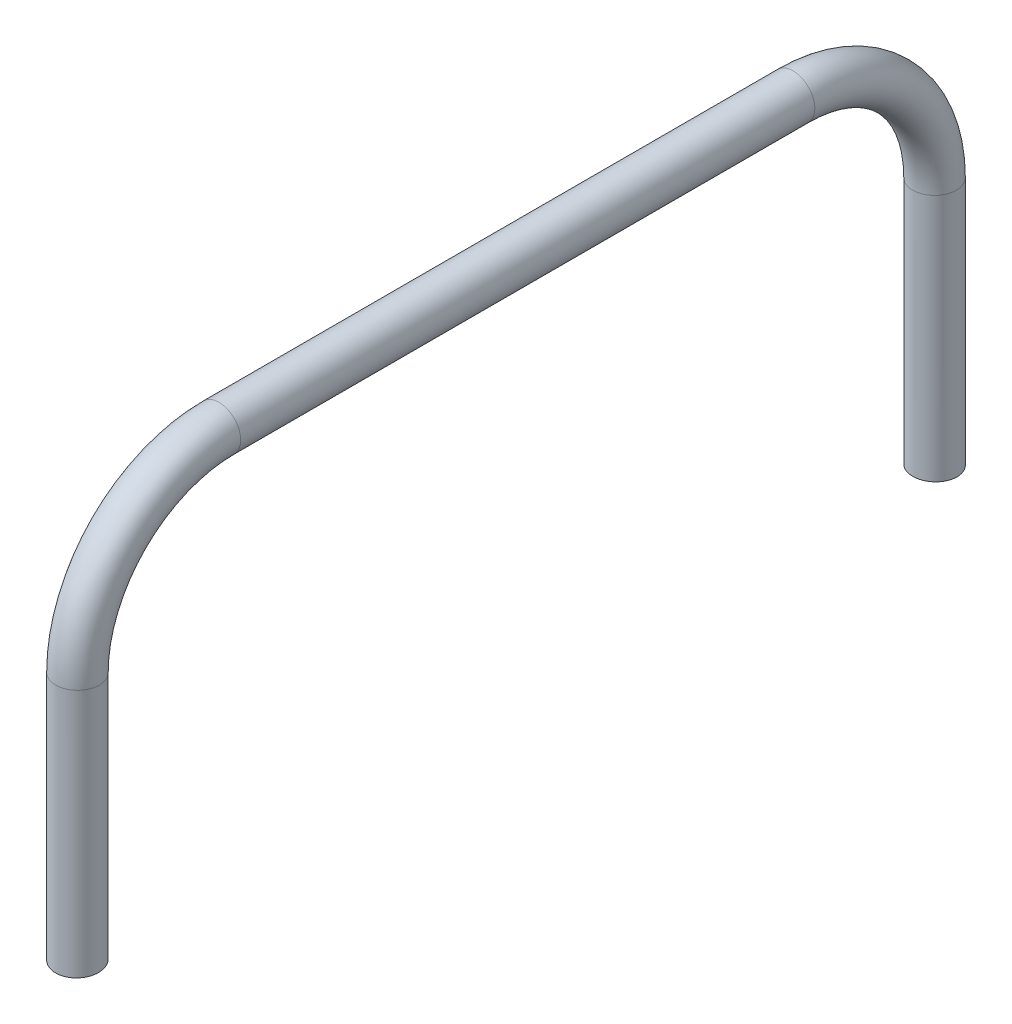
ISO-10303-21;
HEADER;
FILE_DESCRIPTION(('STEP AP214'),'2;1');
FILE_NAME('part.step','',(''),(''),'','','');
FILE_SCHEMA(('AUTOMOTIVE_DESIGN { 1 0 10303 214 1 1 1 1 }'));
ENDSEC;
DATA;
#1=APPLICATION_CONTEXT('core data for automotive mechanical design processes');
#2=APPLICATION_PROTOCOL_DEFINITION('international standard','automotive_design',2000,#1);
#3=PRODUCT_CONTEXT('',#1,'mechanical');
#4=PRODUCT('Part','Part','',(#3));
#5=PRODUCT_RELATED_PRODUCT_CATEGORY('part','',(#4));
#6=PRODUCT_DEFINITION_FORMATION('','',#4);
#7=PRODUCT_DEFINITION_CONTEXT('part definition',#1,'design');
#8=PRODUCT_DEFINITION('design','',#6,#7);
#9=PRODUCT_DEFINITION_SHAPE('','',#8);
#10=(LENGTH_UNIT() NAMED_UNIT(*) SI_UNIT(.MILLI.,.METRE.));
#11=(NAMED_UNIT(*) PLANE_ANGLE_UNIT() SI_UNIT($,.RADIAN.));
#12=(NAMED_UNIT(*) SI_UNIT($,.STERADIAN.) SOLID_ANGLE_UNIT());
#13=UNCERTAINTY_MEASURE_WITH_UNIT(LENGTH_MEASURE(1.E-05),#10,'distance_accuracy_value','');
#14=(GEOMETRIC_REPRESENTATION_CONTEXT(3) GLOBAL_UNCERTAINTY_ASSIGNED_CONTEXT((#13)) GLOBAL_UNIT_ASSIGNED_CONTEXT((#10,
#11,#12)) REPRESENTATION_CONTEXT('',''));
#15=CARTESIAN_POINT('',(0.,0.,0.));
#16=DIRECTION('',(0.,0.,1.));
#17=DIRECTION('',(1.,0.,0.));
#18=AXIS2_PLACEMENT_3D('',#15,#16,#17);
#19=CARTESIAN_POINT('',(899.999999999999,420.499546279117,-167.450000000002));
#20=DIRECTION('',(1.,0.,0.));
#21=DIRECTION('',(0.,0.,-1.));
#22=AXIS2_PLACEMENT_3D('',#19,#20,#21);
#23=TOROIDAL_SURFACE('',#22,82.5499999999968,9.65000000000003);
#24=CARTESIAN_POINT('',(899.999999999999,420.499546279127,-249.999999999998));
#25=DIRECTION('',(0.,1.,1.20409408209324E-13));
#26=DIRECTION('',(0.,-1.20409408209324E-13,1.));
#27=AXIS2_PLACEMENT_3D('',#24,#25,#26);
#28=CIRCLE('',#27,9.65000000000003);
#29=CARTESIAN_POINT('',(899.999999999999,420.499546279128,-259.649999999998));
#30=VERTEX_POINT('',#29);
#31=EDGE_CURVE('E82',#30,#30,#28,.T.);
#32=CARTESIAN_POINT('',(900.,503.049546279118,-167.450000000002));
#33=DIRECTION('',(0.,0.,-1.));
#34=DIRECTION('',(-1.,0.,0.));
#35=AXIS2_PLACEMENT_3D('',#32,#33,#34);
#36=CIRCLE('',#35,9.65000000000003);
#37=CARTESIAN_POINT('',(900.,512.699546279114,-167.450000000002));
#38=VERTEX_POINT('',#37);
#39=EDGE_CURVE('E43',#38,#38,#36,.T.);
#40=CARTESIAN_POINT('',(899.999999999999,420.499546279117,-167.450000000002));
#41=DIRECTION('',(1.,0.,0.));
#42=DIRECTION('',(0.,0.,-1.));
#43=AXIS2_PLACEMENT_3D('',#40,#41,#42);
#44=CIRCLE('',#43,92.1999999999968);
#45=EDGE_CURVE('',#30,#38,#44,.T.);
#46=ORIENTED_EDGE('',*,*,#31,.F.);
#47=ORIENTED_EDGE('',*,*,#39,.F.);
#48=ORIENTED_EDGE('',*,*,#45,.T.);
#49=ORIENTED_EDGE('',*,*,#45,.F.);
#50=EDGE_LOOP('',(#46,#48,#47,#49));
#51=FACE_BOUND('',#50,.T.);
#52=ADVANCED_FACE('F40',(#51),#23,.F.);
#53=CARTESIAN_POINT('',(899.999999999999,420.499546279117,-167.450000000002));
#54=DIRECTION('',(1.,0.,0.));
#55=DIRECTION('',(0.,0.,-1.));
#56=AXIS2_PLACEMENT_3D('',#53,#54,#55);
#57=TOROIDAL_SURFACE('',#56,82.5499999999968,12.7);
#58=CARTESIAN_POINT('',(899.999999999999,420.499546279127,-249.999999999998));
#59=DIRECTION('',(0.,1.,1.20409408209324E-13));
#60=DIRECTION('',(0.,-1.20409408209324E-13,1.));
#61=AXIS2_PLACEMENT_3D('',#58,#59,#60);
#62=CIRCLE('',#61,12.7);
#63=CARTESIAN_POINT('',(899.999999999999,420.499546279129,-262.699999999998));
#64=VERTEX_POINT('',#63);
#65=EDGE_CURVE('E81',#64,#64,#62,.T.);
#66=CARTESIAN_POINT('',(900.,503.049546279118,-167.450000000002));
#67=DIRECTION('',(0.,0.,-1.));
#68=DIRECTION('',(-1.,0.,0.));
#69=AXIS2_PLACEMENT_3D('',#66,#67,#68);
#70=CIRCLE('',#69,12.7);
#71=CARTESIAN_POINT('',(900.,515.749546279114,-167.450000000002));
#72=VERTEX_POINT('',#71);
#73=EDGE_CURVE('E10',#72,#72,#70,.T.);
#74=CARTESIAN_POINT('',(899.999999999999,420.499546279117,-167.450000000002));
#75=DIRECTION('',(1.,0.,0.));
#76=DIRECTION('',(0.,0.,-1.));
#77=AXIS2_PLACEMENT_3D('',#74,#75,#76);
#78=CIRCLE('',#77,95.2499999999968);
#79=EDGE_CURVE('',#64,#72,#78,.T.);
#80=ORIENTED_EDGE('',*,*,#65,.T.);
#81=ORIENTED_EDGE('',*,*,#73,.T.);
#82=ORIENTED_EDGE('',*,*,#79,.T.);
#83=ORIENTED_EDGE('',*,*,#79,.F.);
#84=EDGE_LOOP('',(#80,#82,#81,#83));
#85=FACE_BOUND('',#84,.T.);
#86=ADVANCED_FACE('F98',(#85),#57,.T.);
#87=CARTESIAN_POINT('',(900.,503.049546279118,167.449999999999));
#88=DIRECTION('',(0.,0.,-1.));
#89=DIRECTION('',(-1.,0.,0.));
#90=AXIS2_PLACEMENT_3D('',#87,#88,#89);
#91=CYLINDRICAL_SURFACE('',#90,9.65000000000003);
#92=CARTESIAN_POINT('',(900.,503.049546279118,167.449999999999));
#93=DIRECTION('',(0.,0.,-1.));
#94=DIRECTION('',(-1.,0.,0.));
#95=AXIS2_PLACEMENT_3D('',#92,#93,#94);
#96=CIRCLE('',#95,9.65000000000003);
#97=CARTESIAN_POINT('',(900.,512.699546279118,167.449999999999));
#98=VERTEX_POINT('',#97);
#99=EDGE_CURVE('E56',#98,#98,#96,.T.);
#100=ORIENTED_EDGE('',*,*,#99,.F.);
#101=EDGE_LOOP('',(#100));
#102=FACE_BOUND('',#101,.T.);
#103=ORIENTED_EDGE('',*,*,#39,.T.);
#104=EDGE_LOOP('',(#103));
#105=FACE_BOUND('',#104,.T.);
#106=ADVANCED_FACE('F103',(#102,#105),#91,.F.);
#107=CARTESIAN_POINT('',(900.,503.049546279118,167.449999999999));
#108=DIRECTION('',(0.,0.,-1.));
#109=DIRECTION('',(-1.,0.,0.));
#110=AXIS2_PLACEMENT_3D('',#107,#108,#109);
#111=CYLINDRICAL_SURFACE('',#110,12.7);
#112=CARTESIAN_POINT('',(900.,503.049546279118,167.449999999999));
#113=DIRECTION('',(0.,0.,1.));
#114=DIRECTION('',(1.,0.,0.));
#115=AXIS2_PLACEMENT_3D('',#112,#113,#114);
#116=CIRCLE('',#115,12.7);
#117=CARTESIAN_POINT('',(900.,515.749546279118,167.449999999999));
#118=VERTEX_POINT('',#117);
#119=EDGE_CURVE('E48',#118,#118,#116,.T.);
#120=ORIENTED_EDGE('',*,*,#119,.F.);
#121=EDGE_LOOP('',(#120));
#122=FACE_BOUND('',#121,.T.);
#123=ORIENTED_EDGE('',*,*,#73,.F.);
#124=EDGE_LOOP('',(#123));
#125=FACE_BOUND('',#124,.T.);
#126=ADVANCED_FACE('F123',(#122,#125),#111,.T.);
#127=CARTESIAN_POINT('',(900.,420.499546279117,167.449999999999));
#128=DIRECTION('',(1.,0.,0.));
#129=DIRECTION('',(0.,0.,-1.));
#130=AXIS2_PLACEMENT_3D('',#127,#128,#129);
#131=TOROIDAL_SURFACE('',#130,82.5500000000009,9.65000000000003);
#132=CARTESIAN_POINT('',(899.999999999999,420.499546279117,249.999999999998));
#133=DIRECTION('',(0.,1.,0.));
#134=DIRECTION('',(-1.,0.,0.));
#135=AXIS2_PLACEMENT_3D('',#132,#133,#134);
#136=CIRCLE('',#135,9.65000000000003);
#137=CARTESIAN_POINT('',(899.999999999999,420.499546279117,259.65));
#138=VERTEX_POINT('',#137);
#139=EDGE_CURVE('E65',#138,#138,#136,.T.);
#140=CARTESIAN_POINT('',(900.,420.499546279117,167.449999999999));
#141=DIRECTION('',(1.,0.,0.));
#142=DIRECTION('',(0.,0.,-1.));
#143=AXIS2_PLACEMENT_3D('',#140,#141,#142);
#144=CIRCLE('',#143,92.2000000000009);
#145=EDGE_CURVE('',#98,#138,#144,.T.);
#146=ORIENTED_EDGE('',*,*,#99,.T.);
#147=ORIENTED_EDGE('',*,*,#139,.F.);
#148=ORIENTED_EDGE('',*,*,#145,.T.);
#149=ORIENTED_EDGE('',*,*,#145,.F.);
#150=EDGE_LOOP('',(#146,#148,#147,#149));
#151=FACE_BOUND('',#150,.T.);
#152=ADVANCED_FACE('F129',(#151),#131,.F.);
#153=CARTESIAN_POINT('',(900.,420.499546279117,167.449999999999));
#154=DIRECTION('',(1.,0.,0.));
#155=DIRECTION('',(0.,0.,-1.));
#156=AXIS2_PLACEMENT_3D('',#153,#154,#155);
#157=TOROIDAL_SURFACE('',#156,82.5500000000009,12.7);
#158=CARTESIAN_POINT('',(899.999999999999,420.499546279117,249.999999999998));
#159=DIRECTION('',(0.,1.,0.));
#160=DIRECTION('',(-1.,0.,0.));
#161=AXIS2_PLACEMENT_3D('',#158,#159,#160);
#162=CIRCLE('',#161,12.7);
#163=CARTESIAN_POINT('',(899.999999999999,420.499546279117,262.7));
#164=VERTEX_POINT('',#163);
#165=EDGE_CURVE('E69',#164,#164,#162,.T.);
#166=CARTESIAN_POINT('',(900.,420.499546279117,167.449999999999));
#167=DIRECTION('',(1.,0.,0.));
#168=DIRECTION('',(0.,0.,-1.));
#169=AXIS2_PLACEMENT_3D('',#166,#167,#168);
#170=CIRCLE('',#169,95.2500000000009);
#171=EDGE_CURVE('',#118,#164,#170,.T.);
#172=ORIENTED_EDGE('',*,*,#119,.T.);
#173=ORIENTED_EDGE('',*,*,#165,.T.);
#174=ORIENTED_EDGE('',*,*,#171,.T.);
#175=ORIENTED_EDGE('',*,*,#171,.F.);
#176=EDGE_LOOP('',(#172,#174,#173,#175));
#177=FACE_BOUND('',#176,.T.);
#178=ADVANCED_FACE('F136',(#177),#157,.T.);
#179=CARTESIAN_POINT('',(899.999999999994,275.499546279119,249.999999999999));
#180=DIRECTION('',(0.,1.,0.));
#181=DIRECTION('',(-1.,0.,0.));
#182=AXIS2_PLACEMENT_3D('',#179,#180,#181);
#183=CYLINDRICAL_SURFACE('',#182,9.65000000000003);
#184=CARTESIAN_POINT('',(899.999999999994,275.499546279119,249.999999999999));
#185=DIRECTION('',(0.00229816078026698,0.999408736415618,0.0343059183402114));
#186=DIRECTION('',(-0.0668008812384672,0.0343828093112999,-0.997173738467689));
#187=AXIS2_PLACEMENT_3D('',#184,#185,#186);
#188=ELLIPSE('',#187,9.65570906915401,9.65000000000003);
#189=CARTESIAN_POINT('',(899.354990125192,275.831536682809,240.371580489954));
#190=VERTEX_POINT('',#189);
#191=EDGE_CURVE('E64',#190,#190,#188,.T.);
#192=ORIENTED_EDGE('',*,*,#191,.F.);
#193=EDGE_LOOP('',(#192));
#194=FACE_BOUND('',#193,.T.);
#195=ORIENTED_EDGE('',*,*,#139,.T.);
#196=EDGE_LOOP('',(#195));
#197=FACE_BOUND('',#196,.T.);
#198=ADVANCED_FACE('F140',(#194,#197),#183,.F.);
#199=CARTESIAN_POINT('',(899.999999999994,275.499546279119,249.999999999999));
#200=DIRECTION('',(0.,1.,0.));
#201=DIRECTION('',(-1.,0.,0.));
#202=AXIS2_PLACEMENT_3D('',#199,#200,#201);
#203=CYLINDRICAL_SURFACE('',#202,12.7);
#204=CARTESIAN_POINT('',(899.999999999994,275.499546279119,249.999999999999));
#205=DIRECTION('',(0.00229816078026698,0.999408736415618,0.0343059183402114));
#206=DIRECTION('',(-0.0668008812384672,0.0343828093112999,-0.997173738467689));
#207=AXIS2_PLACEMENT_3D('',#204,#205,#206);
#208=ELLIPSE('',#207,12.7075134899746,12.7);
#209=CARTESIAN_POINT('',(899.151126900514,275.936466292265,237.328401266572));
#210=VERTEX_POINT('',#209);
#211=EDGE_CURVE('E60',#210,#210,#208,.T.);
#212=ORIENTED_EDGE('',*,*,#211,.T.);
#213=EDGE_LOOP('',(#212));
#214=FACE_BOUND('',#213,.T.);
#215=ORIENTED_EDGE('',*,*,#165,.F.);
#216=EDGE_LOOP('',(#215));
#217=FACE_BOUND('',#216,.T.);
#218=ADVANCED_FACE('F142',(#214,#217),#203,.T.);
#219=CARTESIAN_POINT('',(899.999999999994,275.499546279119,249.999999999999));
#220=DIRECTION('',(0.00229816078026698,0.999408736415618,0.0343059183402114));
#221=DIRECTION('',(0.,-0.0343060089346612,0.999411375636167));
#222=AXIS2_PLACEMENT_3D('',#219,#220,#221);
#223=PLANE('',#222);
#224=ORIENTED_EDGE('',*,*,#191,.T.);
#225=EDGE_LOOP('',(#224));
#226=FACE_BOUND('',#225,.T.);
#227=ORIENTED_EDGE('',*,*,#211,.F.);
#228=EDGE_LOOP('',(#227));
#229=FACE_BOUND('',#228,.T.);
#230=ADVANCED_FACE('F145',(#226,#229),#223,.F.);
#231=CARTESIAN_POINT('',(899.999999999999,420.499546279127,-249.999999999998));
#232=DIRECTION('',(0.,-1.,0.));
#233=DIRECTION('',(0.,0.,-1.));
#234=AXIS2_PLACEMENT_3D('',#231,#232,#233);
#235=CYLINDRICAL_SURFACE('',#234,9.65000000000003);
#236=ORIENTED_EDGE('',*,*,#31,.T.);
#237=EDGE_LOOP('',(#236));
#238=FACE_BOUND('',#237,.T.);
#239=CARTESIAN_POINT('',(899.999999999999,275.499546279119,-249.999999999998));
#240=DIRECTION('',(-0.00229816078025704,-0.999408736415632,0.034305918339809));
#241=DIRECTION('',(0.0668008812400526,-0.0343828093108978,-0.997173738467597));
#242=AXIS2_PLACEMENT_3D('',#239,#240,#241);
#243=ELLIPSE('',#242,9.65570906915387,9.65000000000003);
#244=CARTESIAN_POINT('',(900.645009874817,275.167555875433,-259.628419510042));
#245=VERTEX_POINT('',#244);
#246=EDGE_CURVE('E77',#245,#245,#243,.T.);
#247=ORIENTED_EDGE('',*,*,#246,.T.);
#248=EDGE_LOOP('',(#247));
#249=FACE_BOUND('',#248,.T.);
#250=ADVANCED_FACE('F94',(#238,#249),#235,.F.);
#251=CARTESIAN_POINT('',(899.999999999999,420.499546279127,-249.999999999998));
#252=DIRECTION('',(0.,-1.,0.));
#253=DIRECTION('',(0.,0.,-1.));
#254=AXIS2_PLACEMENT_3D('',#251,#252,#253);
#255=CYLINDRICAL_SURFACE('',#254,12.7);
#256=ORIENTED_EDGE('',*,*,#65,.F.);
#257=EDGE_LOOP('',(#256));
#258=FACE_BOUND('',#257,.T.);
#259=CARTESIAN_POINT('',(899.999999999999,275.499546279119,-249.999999999998));
#260=DIRECTION('',(-0.00229816078025704,-0.999408736415632,0.034305918339809));
#261=DIRECTION('',(0.0668008812400526,-0.0343828093108978,-0.997173738467597));
#262=AXIS2_PLACEMENT_3D('',#259,#260,#261);
#263=ELLIPSE('',#262,12.7075134899745,12.7);
#264=CARTESIAN_POINT('',(900.8488730995,275.062626265978,-262.671598733424));
#265=VERTEX_POINT('',#264);
#266=EDGE_CURVE('E70',#265,#265,#263,.T.);
#267=ORIENTED_EDGE('',*,*,#266,.F.);
#268=EDGE_LOOP('',(#267));
#269=FACE_BOUND('',#268,.T.);
#270=ADVANCED_FACE('F156',(#258,#269),#255,.T.);
#271=CARTESIAN_POINT('',(899.999999999999,275.499546279119,-249.999999999998));
#272=DIRECTION('',(-0.00229816078025704,-0.999408736415632,0.034305918339809));
#273=DIRECTION('',(0.,-0.0343060089342588,-0.99941137563618));
#274=AXIS2_PLACEMENT_3D('',#271,#272,#273);
#275=PLANE('',#274);
#276=ORIENTED_EDGE('',*,*,#246,.F.);
#277=EDGE_LOOP('',(#276));
#278=FACE_BOUND('',#277,.T.);
#279=ORIENTED_EDGE('',*,*,#266,.T.);
#280=EDGE_LOOP('',(#279));
#281=FACE_BOUND('',#280,.T.);
#282=ADVANCED_FACE('F153',(#278,#281),#275,.T.);
#283=CLOSED_SHELL('',(#52,#86,#106,#126,#152,#178,#198,#218,#230,#250,#270,#282));
#284=MANIFOLD_SOLID_BREP('B2',#283);
#285=ADVANCED_BREP_SHAPE_REPRESENTATION('',(#18,#284),#14);
#286=SHAPE_DEFINITION_REPRESENTATION(#9,#285);
ENDSEC;
END-ISO-10303-21;
